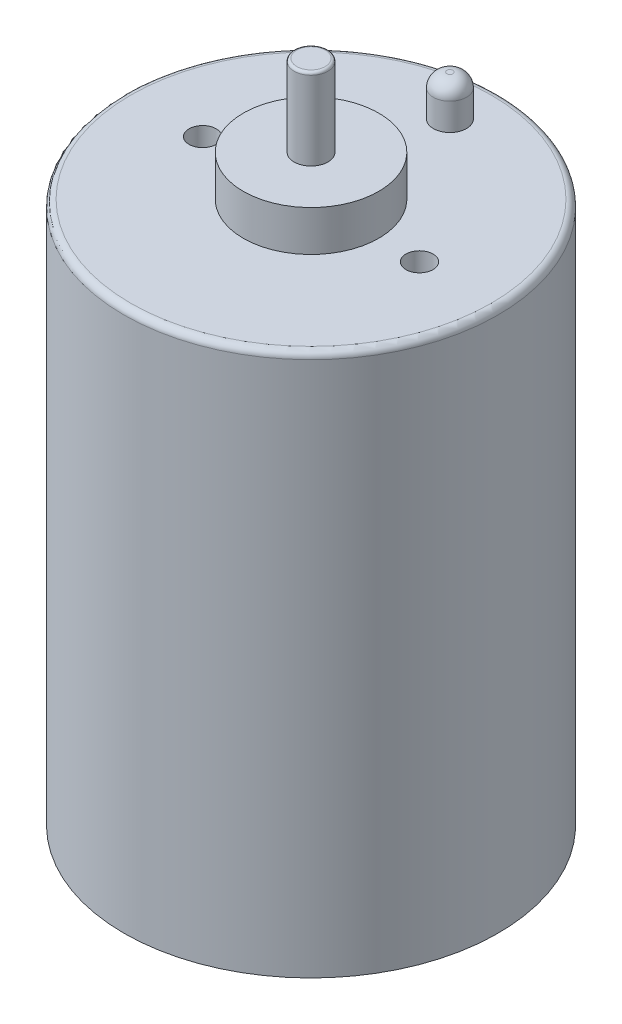
ISO-10303-21;
HEADER;
FILE_DESCRIPTION(('STEP AP214'),'2;1');
FILE_NAME('part.step','',(''),(''),'','','');
FILE_SCHEMA(('AUTOMOTIVE_DESIGN { 1 0 10303 214 1 1 1 1 }'));
ENDSEC;
DATA;
#1=APPLICATION_CONTEXT('core data for automotive mechanical design processes');
#2=APPLICATION_PROTOCOL_DEFINITION('international standard','automotive_design',2000,#1);
#3=PRODUCT_CONTEXT('',#1,'mechanical');
#4=PRODUCT('Part','Part','',(#3));
#5=PRODUCT_RELATED_PRODUCT_CATEGORY('part','',(#4));
#6=PRODUCT_DEFINITION_FORMATION('','',#4);
#7=PRODUCT_DEFINITION_CONTEXT('part definition',#1,'design');
#8=PRODUCT_DEFINITION('design','',#6,#7);
#9=PRODUCT_DEFINITION_SHAPE('','',#8);
#10=(LENGTH_UNIT() NAMED_UNIT(*) SI_UNIT(.MILLI.,.METRE.));
#11=(NAMED_UNIT(*) PLANE_ANGLE_UNIT() SI_UNIT($,.RADIAN.));
#12=(NAMED_UNIT(*) SI_UNIT($,.STERADIAN.) SOLID_ANGLE_UNIT());
#13=UNCERTAINTY_MEASURE_WITH_UNIT(LENGTH_MEASURE(1.E-05),#10,'distance_accuracy_value','');
#14=(GEOMETRIC_REPRESENTATION_CONTEXT(3) GLOBAL_UNCERTAINTY_ASSIGNED_CONTEXT((#13)) GLOBAL_UNIT_ASSIGNED_CONTEXT((#10,
#11,#12)) REPRESENTATION_CONTEXT('',''));
#15=CARTESIAN_POINT('',(0.,0.,0.));
#16=DIRECTION('',(0.,0.,1.));
#17=DIRECTION('',(1.,0.,0.));
#18=AXIS2_PLACEMENT_3D('',#15,#16,#17);
#19=CARTESIAN_POINT('',(0.,40.,0.));
#20=DIRECTION('',(0.,-1.,0.));
#21=DIRECTION('',(0.,0.,-1.));
#22=AXIS2_PLACEMENT_3D('',#19,#20,#21);
#23=CYLINDRICAL_SURFACE('',#22,13.8);
#24=CARTESIAN_POINT('',(0.,39.5,0.));
#25=DIRECTION('',(0.,1.,0.));
#26=DIRECTION('',(0.,0.,1.));
#27=AXIS2_PLACEMENT_3D('',#24,#25,#26);
#28=CIRCLE('',#27,13.8);
#29=CARTESIAN_POINT('',(0.,39.5,13.8));
#30=VERTEX_POINT('',#29);
#31=EDGE_CURVE('E47',#30,#30,#28,.F.);
#32=ORIENTED_EDGE('',*,*,#31,.T.);
#33=EDGE_LOOP('',(#32));
#34=FACE_BOUND('',#33,.T.);
#35=CARTESIAN_POINT('',(0.,0.,0.));
#36=DIRECTION('',(0.,1.,0.));
#37=DIRECTION('',(0.,0.,1.));
#38=AXIS2_PLACEMENT_3D('',#35,#36,#37);
#39=CIRCLE('',#38,13.8);
#40=CARTESIAN_POINT('',(0.,0.,13.8));
#41=VERTEX_POINT('',#40);
#42=EDGE_CURVE('E62',#41,#41,#39,.T.);
#43=ORIENTED_EDGE('',*,*,#42,.T.);
#44=EDGE_LOOP('',(#43));
#45=FACE_BOUND('',#44,.T.);
#46=ADVANCED_FACE('F32',(#34,#45),#23,.T.);
#47=CARTESIAN_POINT('',(0.,40.,0.));
#48=DIRECTION('',(0.,1.,0.));
#49=DIRECTION('',(0.,0.,1.));
#50=AXIS2_PLACEMENT_3D('',#47,#48,#49);
#51=PLANE('',#50);
#52=CARTESIAN_POINT('',(0.,40.,0.));
#53=DIRECTION('',(0.,1.,0.));
#54=DIRECTION('',(0.,0.,1.));
#55=AXIS2_PLACEMENT_3D('',#52,#53,#54);
#56=CIRCLE('',#55,13.3);
#57=CARTESIAN_POINT('',(0.,40.,13.3));
#58=VERTEX_POINT('',#57);
#59=EDGE_CURVE('E52',#58,#58,#56,.T.);
#60=ORIENTED_EDGE('',*,*,#59,.T.);
#61=EDGE_LOOP('',(#60));
#62=FACE_BOUND('',#61,.T.);
#63=CARTESIAN_POINT('',(0.,40.,-10.2469507659596));
#64=DIRECTION('',(0.,1.,0.));
#65=DIRECTION('',(0.,0.,1.));
#66=AXIS2_PLACEMENT_3D('',#63,#64,#65);
#67=CIRCLE('',#66,1.225);
#68=CARTESIAN_POINT('',(0.,40.,-9.0219507659596));
#69=VERTEX_POINT('',#68);
#70=EDGE_CURVE('E75',#69,#69,#67,.T.);
#71=ORIENTED_EDGE('',*,*,#70,.F.);
#72=EDGE_LOOP('',(#71));
#73=FACE_BOUND('',#72,.T.);
#74=CARTESIAN_POINT('',(-8.,40.,0.));
#75=DIRECTION('',(0.,1.,0.));
#76=DIRECTION('',(0.,0.,1.));
#77=AXIS2_PLACEMENT_3D('',#74,#75,#76);
#78=CIRCLE('',#77,1.);
#79=CARTESIAN_POINT('',(-8.,40.,1.));
#80=VERTEX_POINT('',#79);
#81=EDGE_CURVE('E78',#80,#80,#78,.T.);
#82=ORIENTED_EDGE('',*,*,#81,.F.);
#83=EDGE_LOOP('',(#82));
#84=FACE_BOUND('',#83,.T.);
#85=CARTESIAN_POINT('',(8.,40.,0.));
#86=DIRECTION('',(0.,1.,0.));
#87=DIRECTION('',(0.,0.,1.));
#88=AXIS2_PLACEMENT_3D('',#85,#86,#87);
#89=CIRCLE('',#88,1.);
#90=CARTESIAN_POINT('',(8.,40.,0.999999999999999));
#91=VERTEX_POINT('',#90);
#92=EDGE_CURVE('E71',#91,#91,#89,.T.);
#93=ORIENTED_EDGE('',*,*,#92,.F.);
#94=EDGE_LOOP('',(#93));
#95=FACE_BOUND('',#94,.T.);
#96=CARTESIAN_POINT('',(0.,40.,0.));
#97=DIRECTION('',(0.,1.,0.));
#98=DIRECTION('',(0.,0.,1.));
#99=AXIS2_PLACEMENT_3D('',#96,#97,#98);
#100=CIRCLE('',#99,5.);
#101=CARTESIAN_POINT('',(0.,40.,5.));
#102=VERTEX_POINT('',#101);
#103=EDGE_CURVE('E61',#102,#102,#100,.T.);
#104=ORIENTED_EDGE('',*,*,#103,.F.);
#105=EDGE_LOOP('',(#104));
#106=FACE_BOUND('',#105,.T.);
#107=ADVANCED_FACE('F88',(#62,#73,#84,#95,#106),#51,.T.);
#108=CARTESIAN_POINT('',(0.,0.,0.));
#109=DIRECTION('',(0.,1.,0.));
#110=DIRECTION('',(0.,0.,1.));
#111=AXIS2_PLACEMENT_3D('',#108,#109,#110);
#112=PLANE('',#111);
#113=ORIENTED_EDGE('',*,*,#42,.F.);
#114=EDGE_LOOP('',(#113));
#115=FACE_BOUND('',#114,.T.);
#116=ADVANCED_FACE('F91',(#115),#112,.F.);
#117=CARTESIAN_POINT('',(0.,43.,0.));
#118=DIRECTION('',(0.,-1.,0.));
#119=DIRECTION('',(0.,0.,-1.));
#120=AXIS2_PLACEMENT_3D('',#117,#118,#119);
#121=CYLINDRICAL_SURFACE('',#120,5.);
#122=CARTESIAN_POINT('',(0.,43.,0.));
#123=DIRECTION('',(0.,1.,0.));
#124=DIRECTION('',(0.,0.,1.));
#125=AXIS2_PLACEMENT_3D('',#122,#123,#124);
#126=CIRCLE('',#125,5.);
#127=CARTESIAN_POINT('',(0.,43.,5.));
#128=VERTEX_POINT('',#127);
#129=EDGE_CURVE('E65',#128,#128,#126,.T.);
#130=ORIENTED_EDGE('',*,*,#129,.F.);
#131=EDGE_LOOP('',(#130));
#132=FACE_BOUND('',#131,.T.);
#133=ORIENTED_EDGE('',*,*,#103,.T.);
#134=EDGE_LOOP('',(#133));
#135=FACE_BOUND('',#134,.T.);
#136=ADVANCED_FACE('F100',(#132,#135),#121,.T.);
#137=CARTESIAN_POINT('',(0.,43.,0.));
#138=DIRECTION('',(0.,1.,0.));
#139=DIRECTION('',(0.,0.,1.));
#140=AXIS2_PLACEMENT_3D('',#137,#138,#139);
#141=PLANE('',#140);
#142=CARTESIAN_POINT('',(0.,43.,0.));
#143=DIRECTION('',(0.,1.,0.));
#144=DIRECTION('',(0.,0.,1.));
#145=AXIS2_PLACEMENT_3D('',#142,#143,#144);
#146=CIRCLE('',#145,1.25);
#147=CARTESIAN_POINT('',(0.,43.,1.25));
#148=VERTEX_POINT('',#147);
#149=EDGE_CURVE('E43',#148,#148,#146,.T.);
#150=ORIENTED_EDGE('',*,*,#149,.F.);
#151=EDGE_LOOP('',(#150));
#152=FACE_BOUND('',#151,.T.);
#153=ORIENTED_EDGE('',*,*,#129,.T.);
#154=EDGE_LOOP('',(#153));
#155=FACE_BOUND('',#154,.T.);
#156=ADVANCED_FACE('F102',(#152,#155),#141,.T.);
#157=CARTESIAN_POINT('',(8.,37.,0.));
#158=DIRECTION('',(0.,1.,0.));
#159=DIRECTION('',(0.,0.,1.));
#160=AXIS2_PLACEMENT_3D('',#157,#158,#159);
#161=CYLINDRICAL_SURFACE('',#160,1.);
#162=CARTESIAN_POINT('',(8.,37.,0.));
#163=DIRECTION('',(0.,1.,0.));
#164=DIRECTION('',(0.,0.,1.));
#165=AXIS2_PLACEMENT_3D('',#162,#163,#164);
#166=CIRCLE('',#165,1.);
#167=CARTESIAN_POINT('',(8.,37.,0.999999999999999));
#168=VERTEX_POINT('',#167);
#169=EDGE_CURVE('E74',#168,#168,#166,.T.);
#170=ORIENTED_EDGE('',*,*,#169,.F.);
#171=EDGE_LOOP('',(#170));
#172=FACE_BOUND('',#171,.T.);
#173=ORIENTED_EDGE('',*,*,#92,.T.);
#174=EDGE_LOOP('',(#173));
#175=FACE_BOUND('',#174,.T.);
#176=ADVANCED_FACE('F109',(#172,#175),#161,.F.);
#177=CARTESIAN_POINT('',(8.,37.,0.));
#178=DIRECTION('',(0.,1.,0.));
#179=DIRECTION('',(0.,0.,1.));
#180=AXIS2_PLACEMENT_3D('',#177,#178,#179);
#181=PLANE('',#180);
#182=ORIENTED_EDGE('',*,*,#169,.T.);
#183=EDGE_LOOP('',(#182));
#184=FACE_BOUND('',#183,.T.);
#185=ADVANCED_FACE('F157',(#184),#181,.T.);
#186=CARTESIAN_POINT('',(-8.,37.,0.));
#187=DIRECTION('',(0.,1.,0.));
#188=DIRECTION('',(0.,0.,1.));
#189=AXIS2_PLACEMENT_3D('',#186,#187,#188);
#190=CYLINDRICAL_SURFACE('',#189,1.);
#191=CARTESIAN_POINT('',(-8.,37.,0.));
#192=DIRECTION('',(0.,1.,0.));
#193=DIRECTION('',(0.,0.,1.));
#194=AXIS2_PLACEMENT_3D('',#191,#192,#193);
#195=CIRCLE('',#194,1.);
#196=CARTESIAN_POINT('',(-8.,37.,1.));
#197=VERTEX_POINT('',#196);
#198=EDGE_CURVE('E70',#197,#197,#195,.T.);
#199=ORIENTED_EDGE('',*,*,#198,.F.);
#200=EDGE_LOOP('',(#199));
#201=FACE_BOUND('',#200,.T.);
#202=ORIENTED_EDGE('',*,*,#81,.T.);
#203=EDGE_LOOP('',(#202));
#204=FACE_BOUND('',#203,.T.);
#205=ADVANCED_FACE('F153',(#201,#204),#190,.F.);
#206=CARTESIAN_POINT('',(-8.,37.,0.));
#207=DIRECTION('',(0.,1.,0.));
#208=DIRECTION('',(0.,0.,1.));
#209=AXIS2_PLACEMENT_3D('',#206,#207,#208);
#210=PLANE('',#209);
#211=ORIENTED_EDGE('',*,*,#198,.T.);
#212=EDGE_LOOP('',(#211));
#213=FACE_BOUND('',#212,.T.);
#214=ADVANCED_FACE('F149',(#213),#210,.T.);
#215=CARTESIAN_POINT('',(0.,43.,-10.2469507659596));
#216=DIRECTION('',(0.,-1.,0.));
#217=DIRECTION('',(0.,0.,-1.));
#218=AXIS2_PLACEMENT_3D('',#215,#216,#217);
#219=CYLINDRICAL_SURFACE('',#218,1.225);
#220=CARTESIAN_POINT('',(0.,42.,-10.2469507659596));
#221=DIRECTION('',(0.,1.,0.));
#222=DIRECTION('',(0.,0.,1.));
#223=AXIS2_PLACEMENT_3D('',#220,#221,#222);
#224=CIRCLE('',#223,1.225);
#225=CARTESIAN_POINT('',(0.,42.,-9.0219507659596));
#226=VERTEX_POINT('',#225);
#227=EDGE_CURVE('E55',#226,#226,#224,.F.);
#228=ORIENTED_EDGE('',*,*,#227,.T.);
#229=EDGE_LOOP('',(#228));
#230=FACE_BOUND('',#229,.T.);
#231=ORIENTED_EDGE('',*,*,#70,.T.);
#232=EDGE_LOOP('',(#231));
#233=FACE_BOUND('',#232,.T.);
#234=ADVANCED_FACE('F86',(#230,#233),#219,.T.);
#235=CARTESIAN_POINT('',(0.,43.,-10.2469507659596));
#236=DIRECTION('',(0.,1.,0.));
#237=DIRECTION('',(0.,0.,1.));
#238=AXIS2_PLACEMENT_3D('',#235,#236,#237);
#239=PLANE('',#238);
#240=CARTESIAN_POINT('',(0.,43.,-10.2469507659596));
#241=DIRECTION('',(0.,1.,0.));
#242=DIRECTION('',(0.,0.,1.));
#243=AXIS2_PLACEMENT_3D('',#240,#241,#242);
#244=CIRCLE('',#243,0.225);
#245=CARTESIAN_POINT('',(0.,43.,-10.0219507659596));
#246=VERTEX_POINT('',#245);
#247=EDGE_CURVE('E58',#246,#246,#244,.T.);
#248=ORIENTED_EDGE('',*,*,#247,.T.);
#249=EDGE_LOOP('',(#248));
#250=FACE_BOUND('',#249,.T.);
#251=ADVANCED_FACE('F125',(#250),#239,.T.);
#252=CARTESIAN_POINT('',(0.,42.,-10.2469507659596));
#253=DIRECTION('',(0.,1.,0.));
#254=DIRECTION('',(0.,0.,1.));
#255=AXIS2_PLACEMENT_3D('',#252,#253,#254);
#256=DEGENERATE_TOROIDAL_SURFACE('',#255,0.225,1.,.T.);
#257=ORIENTED_EDGE('',*,*,#227,.F.);
#258=EDGE_LOOP('',(#257));
#259=FACE_BOUND('',#258,.T.);
#260=ORIENTED_EDGE('',*,*,#247,.F.);
#261=EDGE_LOOP('',(#260));
#262=FACE_BOUND('',#261,.T.);
#263=ADVANCED_FACE('F122',(#259,#262),#256,.T.);
#264=CARTESIAN_POINT('',(0.,39.5,0.));
#265=DIRECTION('',(0.,1.,0.));
#266=DIRECTION('',(0.,0.,1.));
#267=AXIS2_PLACEMENT_3D('',#264,#265,#266);
#268=TOROIDAL_SURFACE('',#267,13.3,0.5);
#269=ORIENTED_EDGE('',*,*,#31,.F.);
#270=EDGE_LOOP('',(#269));
#271=FACE_BOUND('',#270,.T.);
#272=ORIENTED_EDGE('',*,*,#59,.F.);
#273=EDGE_LOOP('',(#272));
#274=FACE_BOUND('',#273,.T.);
#275=ADVANCED_FACE('F124',(#271,#274),#268,.T.);
#276=CARTESIAN_POINT('',(0.,49.,0.));
#277=DIRECTION('',(0.,-1.,0.));
#278=DIRECTION('',(0.,0.,-1.));
#279=AXIS2_PLACEMENT_3D('',#276,#277,#278);
#280=CYLINDRICAL_SURFACE('',#279,1.25);
#281=CARTESIAN_POINT('',(0.,48.8,0.));
#282=DIRECTION('',(0.,1.,0.));
#283=DIRECTION('',(0.,0.,1.));
#284=AXIS2_PLACEMENT_3D('',#281,#282,#283);
#285=CIRCLE('',#284,1.25);
#286=CARTESIAN_POINT('',(0.,48.8,1.25));
#287=VERTEX_POINT('',#286);
#288=EDGE_CURVE('E10',#287,#287,#285,.F.);
#289=ORIENTED_EDGE('',*,*,#288,.T.);
#290=EDGE_LOOP('',(#289));
#291=FACE_BOUND('',#290,.T.);
#292=ORIENTED_EDGE('',*,*,#149,.T.);
#293=EDGE_LOOP('',(#292));
#294=FACE_BOUND('',#293,.T.);
#295=ADVANCED_FACE('F128',(#291,#294),#280,.T.);
#296=CARTESIAN_POINT('',(0.,49.,0.));
#297=DIRECTION('',(0.,1.,0.));
#298=DIRECTION('',(0.,0.,1.));
#299=AXIS2_PLACEMENT_3D('',#296,#297,#298);
#300=PLANE('',#299);
#301=CARTESIAN_POINT('',(0.,49.,0.));
#302=DIRECTION('',(0.,1.,0.));
#303=DIRECTION('',(0.,0.,1.));
#304=AXIS2_PLACEMENT_3D('',#301,#302,#303);
#305=CIRCLE('',#304,1.05);
#306=CARTESIAN_POINT('',(0.,49.,1.05));
#307=VERTEX_POINT('',#306);
#308=EDGE_CURVE('E39',#307,#307,#305,.T.);
#309=ORIENTED_EDGE('',*,*,#308,.T.);
#310=EDGE_LOOP('',(#309));
#311=FACE_BOUND('',#310,.T.);
#312=ADVANCED_FACE('F133',(#311),#300,.T.);
#313=CARTESIAN_POINT('',(0.,48.8,0.));
#314=DIRECTION('',(0.,1.,0.));
#315=DIRECTION('',(0.,0.,1.));
#316=AXIS2_PLACEMENT_3D('',#313,#314,#315);
#317=TOROIDAL_SURFACE('',#316,1.05,0.2);
#318=ORIENTED_EDGE('',*,*,#288,.F.);
#319=EDGE_LOOP('',(#318));
#320=FACE_BOUND('',#319,.T.);
#321=ORIENTED_EDGE('',*,*,#308,.F.);
#322=EDGE_LOOP('',(#321));
#323=FACE_BOUND('',#322,.T.);
#324=ADVANCED_FACE('F34',(#320,#323),#317,.T.);
#325=CLOSED_SHELL('',(#46,#107,#116,#136,#156,#176,#185,#205,#214,#234,#251,#263,#275,#295,#312,#324));
#326=MANIFOLD_SOLID_BREP('B2',#325);
#327=ADVANCED_BREP_SHAPE_REPRESENTATION('',(#18,#326),#14);
#328=SHAPE_DEFINITION_REPRESENTATION(#9,#327);
ENDSEC;
END-ISO-10303-21;
